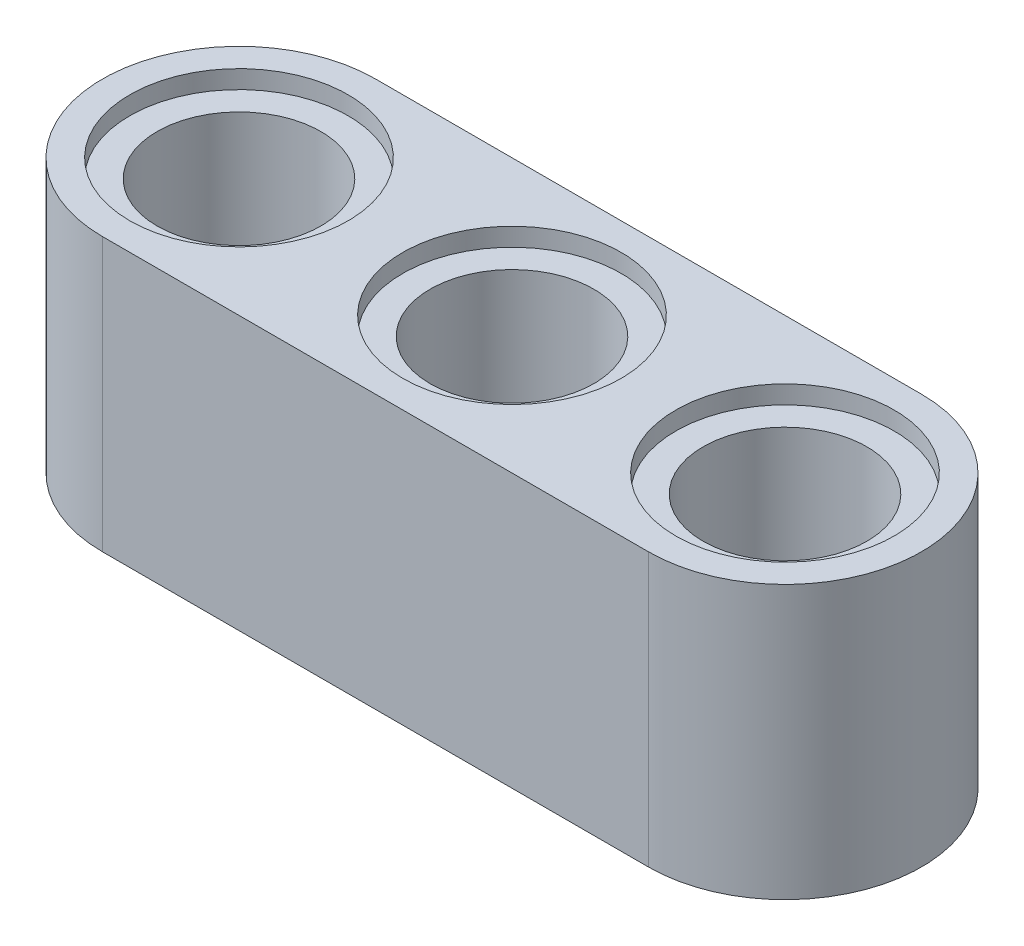
ISO-10303-21;
HEADER;
FILE_DESCRIPTION(('STEP AP214'),'2;1');
FILE_NAME('part.step','',(''),(''),'','','');
FILE_SCHEMA(('AUTOMOTIVE_DESIGN { 1 0 10303 214 1 1 1 1 }'));
ENDSEC;
DATA;
#1=APPLICATION_CONTEXT('core data for automotive mechanical design processes');
#2=APPLICATION_PROTOCOL_DEFINITION('international standard','automotive_design',2000,#1);
#3=PRODUCT_CONTEXT('',#1,'mechanical');
#4=PRODUCT('Part','Part','',(#3));
#5=PRODUCT_RELATED_PRODUCT_CATEGORY('part','',(#4));
#6=PRODUCT_DEFINITION_FORMATION('','',#4);
#7=PRODUCT_DEFINITION_CONTEXT('part definition',#1,'design');
#8=PRODUCT_DEFINITION('design','',#6,#7);
#9=PRODUCT_DEFINITION_SHAPE('','',#8);
#10=(LENGTH_UNIT() NAMED_UNIT(*) SI_UNIT(.MILLI.,.METRE.));
#11=(NAMED_UNIT(*) PLANE_ANGLE_UNIT() SI_UNIT($,.RADIAN.));
#12=(NAMED_UNIT(*) SI_UNIT($,.STERADIAN.) SOLID_ANGLE_UNIT());
#13=UNCERTAINTY_MEASURE_WITH_UNIT(LENGTH_MEASURE(1.E-05),#10,'distance_accuracy_value','');
#14=(GEOMETRIC_REPRESENTATION_CONTEXT(3) GLOBAL_UNCERTAINTY_ASSIGNED_CONTEXT((#13)) GLOBAL_UNIT_ASSIGNED_CONTEXT((#10,
#11,#12)) REPRESENTATION_CONTEXT('',''));
#15=CARTESIAN_POINT('',(0.,0.,0.));
#16=DIRECTION('',(0.,0.,1.));
#17=DIRECTION('',(1.,0.,0.));
#18=AXIS2_PLACEMENT_3D('',#15,#16,#17);
#19=CARTESIAN_POINT('',(0.,2.5,0.));
#20=DIRECTION('',(0.,0.,-1.));
#21=DIRECTION('',(-1.,0.,0.));
#22=AXIS2_PLACEMENT_3D('',#19,#20,#21);
#23=PLANE('',#22);
#24=DIRECTION('',(1.,0.,0.));
#25=VECTOR('',#24,1.);
#26=CARTESIAN_POINT('',(0.,0.,0.));
#27=LINE('',#26,#25);
#28=CARTESIAN_POINT('',(2.5,0.,0.));
#29=VERTEX_POINT('',#28);
#30=CARTESIAN_POINT('',(12.5,0.,0.));
#31=VERTEX_POINT('',#30);
#32=EDGE_CURVE('E119',#29,#31,#27,.T.);
#33=ORIENTED_EDGE('',*,*,#32,.T.);
#34=DIRECTION('',(0.,-1.,0.));
#35=VECTOR('',#34,1.);
#36=CARTESIAN_POINT('',(12.5,2.5,0.));
#37=LINE('',#36,#35);
#38=CARTESIAN_POINT('',(12.5,5.,0.));
#39=VERTEX_POINT('',#38);
#40=EDGE_CURVE('E11',#39,#31,#37,.T.);
#41=ORIENTED_EDGE('',*,*,#40,.F.);
#42=DIRECTION('',(1.,0.,0.));
#43=VECTOR('',#42,1.);
#44=CARTESIAN_POINT('',(0.,5.,0.));
#45=LINE('',#44,#43);
#46=CARTESIAN_POINT('',(2.5,5.,0.));
#47=VERTEX_POINT('',#46);
#48=EDGE_CURVE('E78',#47,#39,#45,.T.);
#49=ORIENTED_EDGE('',*,*,#48,.F.);
#50=DIRECTION('',(0.,-1.,0.));
#51=VECTOR('',#50,1.);
#52=CARTESIAN_POINT('',(2.5,2.5,0.));
#53=LINE('',#52,#51);
#54=EDGE_CURVE('E68',#47,#29,#53,.T.);
#55=ORIENTED_EDGE('',*,*,#54,.T.);
#56=EDGE_LOOP('',(#33,#41,#49,#55));
#57=FACE_BOUND('',#56,.T.);
#58=ADVANCED_FACE('F33',(#57),#23,.F.);
#59=CARTESIAN_POINT('',(12.5,2.5,-2.5));
#60=DIRECTION('',(0.,-1.,0.));
#61=DIRECTION('',(0.,0.,-1.));
#62=AXIS2_PLACEMENT_3D('',#59,#60,#61);
#63=CYLINDRICAL_SURFACE('',#62,2.5);
#64=CARTESIAN_POINT('',(12.5,0.,-2.5));
#65=DIRECTION('',(0.,1.,0.));
#66=DIRECTION('',(0.,0.,1.));
#67=AXIS2_PLACEMENT_3D('',#64,#65,#66);
#68=CIRCLE('',#67,2.5);
#69=CARTESIAN_POINT('',(12.5,0.,-5.));
#70=VERTEX_POINT('',#69);
#71=EDGE_CURVE('E123',#31,#70,#68,.T.);
#72=ORIENTED_EDGE('',*,*,#71,.T.);
#73=DIRECTION('',(0.,-1.,0.));
#74=VECTOR('',#73,1.);
#75=CARTESIAN_POINT('',(12.5,2.5,-5.));
#76=LINE('',#75,#74);
#77=CARTESIAN_POINT('',(12.5,5.,-5.));
#78=VERTEX_POINT('',#77);
#79=EDGE_CURVE('E40',#78,#70,#76,.T.);
#80=ORIENTED_EDGE('',*,*,#79,.F.);
#81=CARTESIAN_POINT('',(12.5,5.,-2.5));
#82=DIRECTION('',(0.,1.,0.));
#83=DIRECTION('',(0.,0.,1.));
#84=AXIS2_PLACEMENT_3D('',#81,#82,#83);
#85=CIRCLE('',#84,2.5);
#86=EDGE_CURVE('E89',#39,#78,#85,.T.);
#87=ORIENTED_EDGE('',*,*,#86,.F.);
#88=ORIENTED_EDGE('',*,*,#40,.T.);
#89=EDGE_LOOP('',(#72,#80,#87,#88));
#90=FACE_BOUND('',#89,.T.);
#91=ADVANCED_FACE('F134',(#90),#63,.T.);
#92=CARTESIAN_POINT('',(0.,2.5,-5.));
#93=DIRECTION('',(0.,0.,-1.));
#94=DIRECTION('',(-1.,0.,0.));
#95=AXIS2_PLACEMENT_3D('',#92,#93,#94);
#96=PLANE('',#95);
#97=DIRECTION('',(1.,0.,0.));
#98=VECTOR('',#97,1.);
#99=CARTESIAN_POINT('',(0.,0.,-5.));
#100=LINE('',#99,#98);
#101=CARTESIAN_POINT('',(2.5,0.,-5.));
#102=VERTEX_POINT('',#101);
#103=EDGE_CURVE('E126',#102,#70,#100,.T.);
#104=ORIENTED_EDGE('',*,*,#103,.F.);
#105=DIRECTION('',(0.,-1.,0.));
#106=VECTOR('',#105,1.);
#107=CARTESIAN_POINT('',(2.5,2.5,-5.));
#108=LINE('',#107,#106);
#109=CARTESIAN_POINT('',(2.5,5.,-5.));
#110=VERTEX_POINT('',#109);
#111=EDGE_CURVE('E52',#110,#102,#108,.T.);
#112=ORIENTED_EDGE('',*,*,#111,.F.);
#113=DIRECTION('',(1.,0.,0.));
#114=VECTOR('',#113,1.);
#115=CARTESIAN_POINT('',(0.,5.,-5.));
#116=LINE('',#115,#114);
#117=EDGE_CURVE('E87',#110,#78,#116,.T.);
#118=ORIENTED_EDGE('',*,*,#117,.T.);
#119=ORIENTED_EDGE('',*,*,#79,.T.);
#120=EDGE_LOOP('',(#104,#112,#118,#119));
#121=FACE_BOUND('',#120,.T.);
#122=ADVANCED_FACE('F132',(#121),#96,.T.);
#123=CARTESIAN_POINT('',(2.5,2.5,-2.5));
#124=DIRECTION('',(0.,-1.,0.));
#125=DIRECTION('',(0.,0.,-1.));
#126=AXIS2_PLACEMENT_3D('',#123,#124,#125);
#127=CYLINDRICAL_SURFACE('',#126,1.5);
#128=CARTESIAN_POINT('',(2.5,4.66666666666667,-2.5));
#129=DIRECTION('',(0.,1.,0.));
#130=DIRECTION('',(0.,0.,1.));
#131=AXIS2_PLACEMENT_3D('',#128,#129,#130);
#132=CIRCLE('',#131,1.5);
#133=CARTESIAN_POINT('',(2.5,4.66666666666667,-1.));
#134=VERTEX_POINT('',#133);
#135=EDGE_CURVE('E175',#134,#134,#132,.T.);
#136=ORIENTED_EDGE('',*,*,#135,.T.);
#137=EDGE_LOOP('',(#136));
#138=FACE_BOUND('',#137,.T.);
#139=CARTESIAN_POINT('',(2.5,0.333333333333333,-2.5));
#140=DIRECTION('',(0.,1.,0.));
#141=DIRECTION('',(0.,0.,1.));
#142=AXIS2_PLACEMENT_3D('',#139,#140,#141);
#143=CIRCLE('',#142,1.5);
#144=CARTESIAN_POINT('',(2.5,0.333333333333333,-1.));
#145=VERTEX_POINT('',#144);
#146=EDGE_CURVE('E106',#145,#145,#143,.T.);
#147=ORIENTED_EDGE('',*,*,#146,.F.);
#148=EDGE_LOOP('',(#147));
#149=FACE_BOUND('',#148,.T.);
#150=ADVANCED_FACE('F159',(#138,#149),#127,.F.);
#151=CARTESIAN_POINT('',(7.5,2.5,-2.5));
#152=DIRECTION('',(0.,-1.,0.));
#153=DIRECTION('',(0.,0.,-1.));
#154=AXIS2_PLACEMENT_3D('',#151,#152,#153);
#155=CYLINDRICAL_SURFACE('',#154,1.5);
#156=CARTESIAN_POINT('',(7.5,4.66666666666667,-2.5));
#157=DIRECTION('',(0.,1.,0.));
#158=DIRECTION('',(0.,0.,1.));
#159=AXIS2_PLACEMENT_3D('',#156,#157,#158);
#160=CIRCLE('',#159,1.5);
#161=CARTESIAN_POINT('',(7.5,4.66666666666667,-0.999999999999999));
#162=VERTEX_POINT('',#161);
#163=EDGE_CURVE('E237',#162,#162,#160,.T.);
#164=ORIENTED_EDGE('',*,*,#163,.T.);
#165=EDGE_LOOP('',(#164));
#166=FACE_BOUND('',#165,.T.);
#167=CARTESIAN_POINT('',(7.5,0.333333333333333,-2.5));
#168=DIRECTION('',(0.,1.,0.));
#169=DIRECTION('',(0.,0.,1.));
#170=AXIS2_PLACEMENT_3D('',#167,#168,#169);
#171=CIRCLE('',#170,1.5);
#172=CARTESIAN_POINT('',(7.5,0.333333333333333,-0.999999999999999));
#173=VERTEX_POINT('',#172);
#174=EDGE_CURVE('E95',#173,#173,#171,.T.);
#175=ORIENTED_EDGE('',*,*,#174,.F.);
#176=EDGE_LOOP('',(#175));
#177=FACE_BOUND('',#176,.T.);
#178=ADVANCED_FACE('F164',(#166,#177),#155,.F.);
#179=CARTESIAN_POINT('',(2.5,2.5,-2.5));
#180=DIRECTION('',(0.,-1.,0.));
#181=DIRECTION('',(0.,0.,-1.));
#182=AXIS2_PLACEMENT_3D('',#179,#180,#181);
#183=CYLINDRICAL_SURFACE('',#182,2.5);
#184=CARTESIAN_POINT('',(2.5,0.,-2.5));
#185=DIRECTION('',(0.,1.,0.));
#186=DIRECTION('',(0.,0.,1.));
#187=AXIS2_PLACEMENT_3D('',#184,#185,#186);
#188=CIRCLE('',#187,2.5);
#189=EDGE_CURVE('E47',#102,#29,#188,.T.);
#190=ORIENTED_EDGE('',*,*,#189,.T.);
#191=ORIENTED_EDGE('',*,*,#54,.F.);
#192=CARTESIAN_POINT('',(2.5,5.,-2.5));
#193=DIRECTION('',(0.,1.,0.));
#194=DIRECTION('',(0.,0.,1.));
#195=AXIS2_PLACEMENT_3D('',#192,#193,#194);
#196=CIRCLE('',#195,2.5);
#197=EDGE_CURVE('E72',#110,#47,#196,.T.);
#198=ORIENTED_EDGE('',*,*,#197,.F.);
#199=ORIENTED_EDGE('',*,*,#111,.T.);
#200=EDGE_LOOP('',(#190,#191,#198,#199));
#201=FACE_BOUND('',#200,.T.);
#202=ADVANCED_FACE('F70',(#201),#183,.T.);
#203=CARTESIAN_POINT('',(12.5,2.5,-2.5));
#204=DIRECTION('',(0.,-1.,0.));
#205=DIRECTION('',(0.,0.,-1.));
#206=AXIS2_PLACEMENT_3D('',#203,#204,#205);
#207=CYLINDRICAL_SURFACE('',#206,1.5);
#208=CARTESIAN_POINT('',(12.5,4.66666666666667,-2.5));
#209=DIRECTION('',(0.,1.,0.));
#210=DIRECTION('',(0.,0.,1.));
#211=AXIS2_PLACEMENT_3D('',#208,#209,#210);
#212=CIRCLE('',#211,1.5);
#213=CARTESIAN_POINT('',(12.5,4.66666666666667,-0.999999999999999));
#214=VERTEX_POINT('',#213);
#215=EDGE_CURVE('E244',#214,#214,#212,.T.);
#216=ORIENTED_EDGE('',*,*,#215,.T.);
#217=EDGE_LOOP('',(#216));
#218=FACE_BOUND('',#217,.T.);
#219=CARTESIAN_POINT('',(12.5,0.333333333333333,-2.5));
#220=DIRECTION('',(0.,1.,0.));
#221=DIRECTION('',(0.,0.,1.));
#222=AXIS2_PLACEMENT_3D('',#219,#220,#221);
#223=CIRCLE('',#222,1.5);
#224=CARTESIAN_POINT('',(12.5,0.333333333333333,-0.999999999999999));
#225=VERTEX_POINT('',#224);
#226=EDGE_CURVE('E113',#225,#225,#223,.T.);
#227=ORIENTED_EDGE('',*,*,#226,.F.);
#228=EDGE_LOOP('',(#227));
#229=FACE_BOUND('',#228,.T.);
#230=ADVANCED_FACE('F139',(#218,#229),#207,.F.);
#231=CARTESIAN_POINT('',(0.,0.,0.));
#232=DIRECTION('',(0.,1.,0.));
#233=DIRECTION('',(0.,0.,1.));
#234=AXIS2_PLACEMENT_3D('',#231,#232,#233);
#235=PLANE('',#234);
#236=CARTESIAN_POINT('',(7.5,0.,-2.5));
#237=DIRECTION('',(0.,1.,0.));
#238=DIRECTION('',(0.,0.,1.));
#239=AXIS2_PLACEMENT_3D('',#236,#237,#238);
#240=CIRCLE('',#239,2.);
#241=CARTESIAN_POINT('',(7.5,0.,-0.499999999999998));
#242=VERTEX_POINT('',#241);
#243=EDGE_CURVE('E99',#242,#242,#240,.T.);
#244=ORIENTED_EDGE('',*,*,#243,.T.);
#245=EDGE_LOOP('',(#244));
#246=FACE_BOUND('',#245,.T.);
#247=CARTESIAN_POINT('',(2.5,0.,-2.5));
#248=DIRECTION('',(0.,1.,0.));
#249=DIRECTION('',(0.,0.,1.));
#250=AXIS2_PLACEMENT_3D('',#247,#248,#249);
#251=CIRCLE('',#250,2.);
#252=CARTESIAN_POINT('',(2.5,0.,-0.499999999999999));
#253=VERTEX_POINT('',#252);
#254=EDGE_CURVE('E94',#253,#253,#251,.T.);
#255=ORIENTED_EDGE('',*,*,#254,.T.);
#256=EDGE_LOOP('',(#255));
#257=FACE_BOUND('',#256,.T.);
#258=CARTESIAN_POINT('',(12.5,0.,-2.5));
#259=DIRECTION('',(0.,1.,0.));
#260=DIRECTION('',(0.,0.,1.));
#261=AXIS2_PLACEMENT_3D('',#258,#259,#260);
#262=CIRCLE('',#261,2.);
#263=CARTESIAN_POINT('',(12.5,0.,-0.5));
#264=VERTEX_POINT('',#263);
#265=EDGE_CURVE('E102',#264,#264,#262,.T.);
#266=ORIENTED_EDGE('',*,*,#265,.T.);
#267=EDGE_LOOP('',(#266));
#268=FACE_BOUND('',#267,.T.);
#269=ORIENTED_EDGE('',*,*,#32,.F.);
#270=ORIENTED_EDGE('',*,*,#189,.F.);
#271=ORIENTED_EDGE('',*,*,#103,.T.);
#272=ORIENTED_EDGE('',*,*,#71,.F.);
#273=EDGE_LOOP('',(#269,#270,#271,#272));
#274=FACE_BOUND('',#273,.T.);
#275=ADVANCED_FACE('F136',(#246,#257,#268,#274),#235,.F.);
#276=CARTESIAN_POINT('',(12.5,0.333333333333333,-2.5));
#277=DIRECTION('',(0.,-1.,0.));
#278=DIRECTION('',(0.,0.,-1.));
#279=AXIS2_PLACEMENT_3D('',#276,#277,#278);
#280=CYLINDRICAL_SURFACE('',#279,2.);
#281=CARTESIAN_POINT('',(12.5,0.333333333333333,-2.5));
#282=DIRECTION('',(0.,1.,0.));
#283=DIRECTION('',(0.,0.,1.));
#284=AXIS2_PLACEMENT_3D('',#281,#282,#283);
#285=CIRCLE('',#284,2.);
#286=CARTESIAN_POINT('',(12.5,0.333333333333333,-0.5));
#287=VERTEX_POINT('',#286);
#288=EDGE_CURVE('E116',#287,#287,#285,.T.);
#289=ORIENTED_EDGE('',*,*,#288,.T.);
#290=EDGE_LOOP('',(#289));
#291=FACE_BOUND('',#290,.T.);
#292=ORIENTED_EDGE('',*,*,#265,.F.);
#293=EDGE_LOOP('',(#292));
#294=FACE_BOUND('',#293,.T.);
#295=ADVANCED_FACE('F138',(#291,#294),#280,.F.);
#296=CARTESIAN_POINT('',(0.,0.333333333333333,0.));
#297=DIRECTION('',(0.,1.,0.));
#298=DIRECTION('',(0.,0.,1.));
#299=AXIS2_PLACEMENT_3D('',#296,#297,#298);
#300=PLANE('',#299);
#301=ORIENTED_EDGE('',*,*,#226,.T.);
#302=EDGE_LOOP('',(#301));
#303=FACE_BOUND('',#302,.T.);
#304=ORIENTED_EDGE('',*,*,#288,.F.);
#305=EDGE_LOOP('',(#304));
#306=FACE_BOUND('',#305,.T.);
#307=ADVANCED_FACE('F146',(#303,#306),#300,.F.);
#308=CARTESIAN_POINT('',(2.5,0.333333333333333,-2.5));
#309=DIRECTION('',(0.,-1.,0.));
#310=DIRECTION('',(0.,0.,-1.));
#311=AXIS2_PLACEMENT_3D('',#308,#309,#310);
#312=CYLINDRICAL_SURFACE('',#311,2.);
#313=CARTESIAN_POINT('',(2.5,0.333333333333333,-2.5));
#314=DIRECTION('',(0.,1.,0.));
#315=DIRECTION('',(0.,0.,1.));
#316=AXIS2_PLACEMENT_3D('',#313,#314,#315);
#317=CIRCLE('',#316,2.);
#318=CARTESIAN_POINT('',(2.5,0.333333333333333,-0.499999999999999));
#319=VERTEX_POINT('',#318);
#320=EDGE_CURVE('E105',#319,#319,#317,.T.);
#321=ORIENTED_EDGE('',*,*,#320,.T.);
#322=EDGE_LOOP('',(#321));
#323=FACE_BOUND('',#322,.T.);
#324=ORIENTED_EDGE('',*,*,#254,.F.);
#325=EDGE_LOOP('',(#324));
#326=FACE_BOUND('',#325,.T.);
#327=ADVANCED_FACE('F182',(#323,#326),#312,.F.);
#328=CARTESIAN_POINT('',(0.,0.333333333333333,0.));
#329=DIRECTION('',(0.,1.,0.));
#330=DIRECTION('',(0.,0.,1.));
#331=AXIS2_PLACEMENT_3D('',#328,#329,#330);
#332=PLANE('',#331);
#333=ORIENTED_EDGE('',*,*,#146,.T.);
#334=EDGE_LOOP('',(#333));
#335=FACE_BOUND('',#334,.T.);
#336=ORIENTED_EDGE('',*,*,#320,.F.);
#337=EDGE_LOOP('',(#336));
#338=FACE_BOUND('',#337,.T.);
#339=ADVANCED_FACE('F178',(#335,#338),#332,.F.);
#340=CARTESIAN_POINT('',(7.5,0.333333333333333,-2.5));
#341=DIRECTION('',(0.,-1.,0.));
#342=DIRECTION('',(0.,0.,-1.));
#343=AXIS2_PLACEMENT_3D('',#340,#341,#342);
#344=CYLINDRICAL_SURFACE('',#343,2.);
#345=CARTESIAN_POINT('',(7.5,0.333333333333333,-2.5));
#346=DIRECTION('',(0.,1.,0.));
#347=DIRECTION('',(0.,0.,1.));
#348=AXIS2_PLACEMENT_3D('',#345,#346,#347);
#349=CIRCLE('',#348,2.);
#350=CARTESIAN_POINT('',(7.5,0.333333333333333,-0.499999999999998));
#351=VERTEX_POINT('',#350);
#352=EDGE_CURVE('E98',#351,#351,#349,.T.);
#353=ORIENTED_EDGE('',*,*,#352,.T.);
#354=EDGE_LOOP('',(#353));
#355=FACE_BOUND('',#354,.T.);
#356=ORIENTED_EDGE('',*,*,#243,.F.);
#357=EDGE_LOOP('',(#356));
#358=FACE_BOUND('',#357,.T.);
#359=ADVANCED_FACE('F181',(#355,#358),#344,.F.);
#360=CARTESIAN_POINT('',(0.,0.333333333333333,0.));
#361=DIRECTION('',(0.,1.,0.));
#362=DIRECTION('',(0.,0.,1.));
#363=AXIS2_PLACEMENT_3D('',#360,#361,#362);
#364=PLANE('',#363);
#365=ORIENTED_EDGE('',*,*,#174,.T.);
#366=EDGE_LOOP('',(#365));
#367=FACE_BOUND('',#366,.T.);
#368=ORIENTED_EDGE('',*,*,#352,.F.);
#369=EDGE_LOOP('',(#368));
#370=FACE_BOUND('',#369,.T.);
#371=ADVANCED_FACE('F201',(#367,#370),#364,.F.);
#372=CARTESIAN_POINT('',(0.,5.,0.));
#373=DIRECTION('',(0.,-1.,0.));
#374=DIRECTION('',(0.,0.,1.));
#375=AXIS2_PLACEMENT_3D('',#372,#373,#374);
#376=PLANE('',#375);
#377=CARTESIAN_POINT('',(7.5,5.,-2.5));
#378=DIRECTION('',(0.,1.,0.));
#379=DIRECTION('',(0.,0.,1.));
#380=AXIS2_PLACEMENT_3D('',#377,#378,#379);
#381=CIRCLE('',#380,2.);
#382=CARTESIAN_POINT('',(7.5,5.,-0.499999999999998));
#383=VERTEX_POINT('',#382);
#384=EDGE_CURVE('E245',#383,#383,#381,.T.);
#385=ORIENTED_EDGE('',*,*,#384,.F.);
#386=EDGE_LOOP('',(#385));
#387=FACE_BOUND('',#386,.T.);
#388=CARTESIAN_POINT('',(2.5,5.,-2.5));
#389=DIRECTION('',(0.,1.,0.));
#390=DIRECTION('',(0.,0.,1.));
#391=AXIS2_PLACEMENT_3D('',#388,#389,#390);
#392=CIRCLE('',#391,2.);
#393=CARTESIAN_POINT('',(2.5,5.,-0.499999999999999));
#394=VERTEX_POINT('',#393);
#395=EDGE_CURVE('E252',#394,#394,#392,.T.);
#396=ORIENTED_EDGE('',*,*,#395,.F.);
#397=EDGE_LOOP('',(#396));
#398=FACE_BOUND('',#397,.T.);
#399=CARTESIAN_POINT('',(12.5,5.,-2.5));
#400=DIRECTION('',(0.,1.,0.));
#401=DIRECTION('',(0.,0.,1.));
#402=AXIS2_PLACEMENT_3D('',#399,#400,#401);
#403=CIRCLE('',#402,2.);
#404=CARTESIAN_POINT('',(12.5,5.,-0.5));
#405=VERTEX_POINT('',#404);
#406=EDGE_CURVE('E241',#405,#405,#403,.T.);
#407=ORIENTED_EDGE('',*,*,#406,.F.);
#408=EDGE_LOOP('',(#407));
#409=FACE_BOUND('',#408,.T.);
#410=ORIENTED_EDGE('',*,*,#48,.T.);
#411=ORIENTED_EDGE('',*,*,#86,.T.);
#412=ORIENTED_EDGE('',*,*,#117,.F.);
#413=ORIENTED_EDGE('',*,*,#197,.T.);
#414=EDGE_LOOP('',(#410,#411,#412,#413));
#415=FACE_BOUND('',#414,.T.);
#416=ADVANCED_FACE('F85',(#387,#398,#409,#415),#376,.F.);
#417=CARTESIAN_POINT('',(12.5,4.66666666666667,-2.5));
#418=DIRECTION('',(0.,1.,0.));
#419=DIRECTION('',(0.,0.,1.));
#420=AXIS2_PLACEMENT_3D('',#417,#418,#419);
#421=CYLINDRICAL_SURFACE('',#420,2.);
#422=CARTESIAN_POINT('',(12.5,4.66666666666667,-2.5));
#423=DIRECTION('',(0.,1.,0.));
#424=DIRECTION('',(0.,0.,1.));
#425=AXIS2_PLACEMENT_3D('',#422,#423,#424);
#426=CIRCLE('',#425,2.);
#427=CARTESIAN_POINT('',(12.5,4.66666666666667,-0.5));
#428=VERTEX_POINT('',#427);
#429=EDGE_CURVE('E82',#428,#428,#426,.T.);
#430=ORIENTED_EDGE('',*,*,#429,.F.);
#431=EDGE_LOOP('',(#430));
#432=FACE_BOUND('',#431,.T.);
#433=ORIENTED_EDGE('',*,*,#406,.T.);
#434=EDGE_LOOP('',(#433));
#435=FACE_BOUND('',#434,.T.);
#436=ADVANCED_FACE('F208',(#432,#435),#421,.F.);
#437=CARTESIAN_POINT('',(0.,4.66666666666667,0.));
#438=DIRECTION('',(0.,-1.,0.));
#439=DIRECTION('',(0.,0.,1.));
#440=AXIS2_PLACEMENT_3D('',#437,#438,#439);
#441=PLANE('',#440);
#442=ORIENTED_EDGE('',*,*,#215,.F.);
#443=EDGE_LOOP('',(#442));
#444=FACE_BOUND('',#443,.T.);
#445=ORIENTED_EDGE('',*,*,#429,.T.);
#446=EDGE_LOOP('',(#445));
#447=FACE_BOUND('',#446,.T.);
#448=ADVANCED_FACE('F212',(#444,#447),#441,.F.);
#449=CARTESIAN_POINT('',(2.5,4.66666666666667,-2.5));
#450=DIRECTION('',(0.,1.,0.));
#451=DIRECTION('',(0.,0.,1.));
#452=AXIS2_PLACEMENT_3D('',#449,#450,#451);
#453=CYLINDRICAL_SURFACE('',#452,2.);
#454=CARTESIAN_POINT('',(2.5,4.66666666666667,-2.5));
#455=DIRECTION('',(0.,1.,0.));
#456=DIRECTION('',(0.,0.,1.));
#457=AXIS2_PLACEMENT_3D('',#454,#455,#456);
#458=CIRCLE('',#457,2.);
#459=CARTESIAN_POINT('',(2.5,4.66666666666667,-0.499999999999999));
#460=VERTEX_POINT('',#459);
#461=EDGE_CURVE('E250',#460,#460,#458,.T.);
#462=ORIENTED_EDGE('',*,*,#461,.F.);
#463=EDGE_LOOP('',(#462));
#464=FACE_BOUND('',#463,.T.);
#465=ORIENTED_EDGE('',*,*,#395,.T.);
#466=EDGE_LOOP('',(#465));
#467=FACE_BOUND('',#466,.T.);
#468=ADVANCED_FACE('F216',(#464,#467),#453,.F.);
#469=CARTESIAN_POINT('',(0.,4.66666666666667,0.));
#470=DIRECTION('',(0.,-1.,0.));
#471=DIRECTION('',(0.,0.,1.));
#472=AXIS2_PLACEMENT_3D('',#469,#470,#471);
#473=PLANE('',#472);
#474=ORIENTED_EDGE('',*,*,#135,.F.);
#475=EDGE_LOOP('',(#474));
#476=FACE_BOUND('',#475,.T.);
#477=ORIENTED_EDGE('',*,*,#461,.T.);
#478=EDGE_LOOP('',(#477));
#479=FACE_BOUND('',#478,.T.);
#480=ADVANCED_FACE('F220',(#476,#479),#473,.F.);
#481=CARTESIAN_POINT('',(7.5,4.66666666666667,-2.5));
#482=DIRECTION('',(0.,1.,0.));
#483=DIRECTION('',(0.,0.,1.));
#484=AXIS2_PLACEMENT_3D('',#481,#482,#483);
#485=CYLINDRICAL_SURFACE('',#484,2.);
#486=CARTESIAN_POINT('',(7.5,4.66666666666667,-2.5));
#487=DIRECTION('',(0.,1.,0.));
#488=DIRECTION('',(0.,0.,1.));
#489=AXIS2_PLACEMENT_3D('',#486,#487,#488);
#490=CIRCLE('',#489,2.);
#491=CARTESIAN_POINT('',(7.5,4.66666666666667,-0.499999999999998));
#492=VERTEX_POINT('',#491);
#493=EDGE_CURVE('E240',#492,#492,#490,.T.);
#494=ORIENTED_EDGE('',*,*,#493,.F.);
#495=EDGE_LOOP('',(#494));
#496=FACE_BOUND('',#495,.T.);
#497=ORIENTED_EDGE('',*,*,#384,.T.);
#498=EDGE_LOOP('',(#497));
#499=FACE_BOUND('',#498,.T.);
#500=ADVANCED_FACE('F224',(#496,#499),#485,.F.);
#501=CARTESIAN_POINT('',(0.,4.66666666666667,0.));
#502=DIRECTION('',(0.,-1.,0.));
#503=DIRECTION('',(0.,0.,1.));
#504=AXIS2_PLACEMENT_3D('',#501,#502,#503);
#505=PLANE('',#504);
#506=ORIENTED_EDGE('',*,*,#163,.F.);
#507=EDGE_LOOP('',(#506));
#508=FACE_BOUND('',#507,.T.);
#509=ORIENTED_EDGE('',*,*,#493,.T.);
#510=EDGE_LOOP('',(#509));
#511=FACE_BOUND('',#510,.T.);
#512=ADVANCED_FACE('F228',(#508,#511),#505,.F.);
#513=CLOSED_SHELL('',(#58,#91,#122,#150,#178,#202,#230,#275,#295,#307,#327,#339,#359,#371,#416,
#436,#448,#468,#480,#500,#512));
#514=MANIFOLD_SOLID_BREP('B2',#513);
#515=ADVANCED_BREP_SHAPE_REPRESENTATION('',(#18,#514),#14);
#516=SHAPE_DEFINITION_REPRESENTATION(#9,#515);
ENDSEC;
END-ISO-10303-21;
